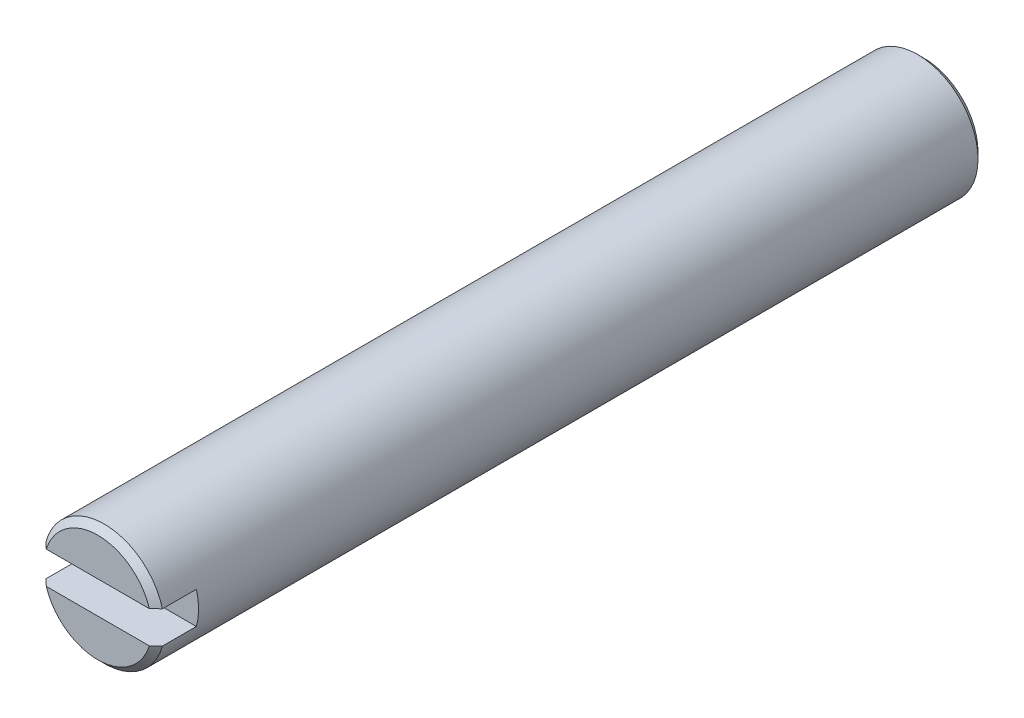
ISO-10303-21;
HEADER;
FILE_DESCRIPTION(('STEP AP214'),'2;1');
FILE_NAME('part.step','',(''),(''),'','','');
FILE_SCHEMA(('AUTOMOTIVE_DESIGN { 1 0 10303 214 1 1 1 1 }'));
ENDSEC;
DATA;
#1=APPLICATION_CONTEXT('core data for automotive mechanical design processes');
#2=APPLICATION_PROTOCOL_DEFINITION('international standard','automotive_design',2000,#1);
#3=PRODUCT_CONTEXT('',#1,'mechanical');
#4=PRODUCT('Part','Part','',(#3));
#5=PRODUCT_RELATED_PRODUCT_CATEGORY('part','',(#4));
#6=PRODUCT_DEFINITION_FORMATION('','',#4);
#7=PRODUCT_DEFINITION_CONTEXT('part definition',#1,'design');
#8=PRODUCT_DEFINITION('design','',#6,#7);
#9=PRODUCT_DEFINITION_SHAPE('','',#8);
#10=(LENGTH_UNIT() NAMED_UNIT(*) SI_UNIT(.MILLI.,.METRE.));
#11=(NAMED_UNIT(*) PLANE_ANGLE_UNIT() SI_UNIT($,.RADIAN.));
#12=(NAMED_UNIT(*) SI_UNIT($,.STERADIAN.) SOLID_ANGLE_UNIT());
#13=UNCERTAINTY_MEASURE_WITH_UNIT(LENGTH_MEASURE(1.E-05),#10,'distance_accuracy_value','');
#14=(GEOMETRIC_REPRESENTATION_CONTEXT(3) GLOBAL_UNCERTAINTY_ASSIGNED_CONTEXT((#13)) GLOBAL_UNIT_ASSIGNED_CONTEXT((#10,
#11,#12)) REPRESENTATION_CONTEXT('',''));
#15=CARTESIAN_POINT('',(0.,0.,0.));
#16=DIRECTION('',(0.,0.,1.));
#17=DIRECTION('',(1.,0.,0.));
#18=AXIS2_PLACEMENT_3D('',#15,#16,#17);
#19=CARTESIAN_POINT('',(0.,0.,25.63));
#20=DIRECTION('',(0.,0.,-1.));
#21=DIRECTION('',(-1.,0.,0.));
#22=AXIS2_PLACEMENT_3D('',#19,#20,#21);
#23=CYLINDRICAL_SURFACE('',#22,1.875);
#24=CARTESIAN_POINT('',(0.,0.,0.199999999999999));
#25=DIRECTION('',(0.,0.,1.));
#26=DIRECTION('',(1.,0.,0.));
#27=AXIS2_PLACEMENT_3D('',#24,#25,#26);
#28=CIRCLE('',#27,1.875);
#29=CARTESIAN_POINT('',(1.875,0.,0.199999999999999));
#30=VERTEX_POINT('',#29);
#31=EDGE_CURVE('E53',#30,#30,#28,.T.);
#32=ORIENTED_EDGE('',*,*,#31,.T.);
#33=EDGE_LOOP('',(#32));
#34=FACE_BOUND('',#33,.T.);
#35=DIRECTION('',(0.,0.,1.));
#36=VECTOR('',#35,1.);
#37=CARTESIAN_POINT('',(1.80710403685012,-0.5,24.38));
#38=LINE('',#37,#36);
#39=CARTESIAN_POINT('',(1.80710403685012,-0.5,24.38));
#40=VERTEX_POINT('',#39);
#41=CARTESIAN_POINT('',(1.80710403685012,-0.5,25.43));
#42=VERTEX_POINT('',#41);
#43=EDGE_CURVE('E109',#40,#42,#38,.T.);
#44=ORIENTED_EDGE('',*,*,#43,.T.);
#45=CARTESIAN_POINT('',(0.,0.,25.43));
#46=DIRECTION('',(0.,0.,1.));
#47=DIRECTION('',(1.,0.,0.));
#48=AXIS2_PLACEMENT_3D('',#45,#46,#47);
#49=CIRCLE('',#48,1.875);
#50=CARTESIAN_POINT('',(-1.80710403685012,-0.5,25.43));
#51=VERTEX_POINT('',#50);
#52=EDGE_CURVE('E127',#42,#51,#49,.F.);
#53=ORIENTED_EDGE('',*,*,#52,.T.);
#54=DIRECTION('',(0.,0.,1.));
#55=VECTOR('',#54,1.);
#56=CARTESIAN_POINT('',(-1.80710403685012,-0.5,24.38));
#57=LINE('',#56,#55);
#58=CARTESIAN_POINT('',(-1.80710403685012,-0.5,24.38));
#59=VERTEX_POINT('',#58);
#60=EDGE_CURVE('E106',#59,#51,#57,.T.);
#61=ORIENTED_EDGE('',*,*,#60,.F.);
#62=CARTESIAN_POINT('',(0.,0.,24.38));
#63=DIRECTION('',(0.,0.,1.));
#64=DIRECTION('',(1.,0.,0.));
#65=AXIS2_PLACEMENT_3D('',#62,#63,#64);
#66=CIRCLE('',#65,1.875);
#67=CARTESIAN_POINT('',(-1.80710403685012,0.5,24.38));
#68=VERTEX_POINT('',#67);
#69=EDGE_CURVE('E115',#68,#59,#66,.T.);
#70=ORIENTED_EDGE('',*,*,#69,.F.);
#71=DIRECTION('',(0.,0.,1.));
#72=VECTOR('',#71,1.);
#73=CARTESIAN_POINT('',(-1.80710403685012,0.5,24.38));
#74=LINE('',#73,#72);
#75=CARTESIAN_POINT('',(-1.80710403685012,0.5,25.43));
#76=VERTEX_POINT('',#75);
#77=EDGE_CURVE('E142',#68,#76,#74,.T.);
#78=ORIENTED_EDGE('',*,*,#77,.T.);
#79=CARTESIAN_POINT('',(0.,0.,25.43));
#80=DIRECTION('',(0.,0.,1.));
#81=DIRECTION('',(1.,0.,0.));
#82=AXIS2_PLACEMENT_3D('',#79,#80,#81);
#83=CIRCLE('',#82,1.875);
#84=CARTESIAN_POINT('',(1.80710403685012,0.5,25.43));
#85=VERTEX_POINT('',#84);
#86=EDGE_CURVE('E212',#76,#85,#83,.F.);
#87=ORIENTED_EDGE('',*,*,#86,.T.);
#88=DIRECTION('',(0.,0.,1.));
#89=VECTOR('',#88,1.);
#90=CARTESIAN_POINT('',(1.80710403685012,0.5,24.38));
#91=LINE('',#90,#89);
#92=CARTESIAN_POINT('',(1.80710403685012,0.5,24.38));
#93=VERTEX_POINT('',#92);
#94=EDGE_CURVE('E132',#93,#85,#91,.T.);
#95=ORIENTED_EDGE('',*,*,#94,.F.);
#96=CARTESIAN_POINT('',(0.,0.,24.38));
#97=DIRECTION('',(0.,0.,1.));
#98=DIRECTION('',(1.,0.,0.));
#99=AXIS2_PLACEMENT_3D('',#96,#97,#98);
#100=CIRCLE('',#99,1.875);
#101=EDGE_CURVE('E114',#40,#93,#100,.T.);
#102=ORIENTED_EDGE('',*,*,#101,.F.);
#103=EDGE_LOOP('',(#44,#53,#61,#70,#78,#87,#95,#102));
#104=FACE_BOUND('',#103,.T.);
#105=ADVANCED_FACE('F43',(#34,#104),#23,.T.);
#106=CARTESIAN_POINT('',(0.,0.,25.63));
#107=DIRECTION('',(0.,0.,1.));
#108=DIRECTION('',(1.,0.,0.));
#109=AXIS2_PLACEMENT_3D('',#106,#107,#108);
#110=PLANE('',#109);
#111=DIRECTION('',(1.,0.,0.));
#112=VECTOR('',#111,1.);
#113=CARTESIAN_POINT('',(-1.80710403685012,0.5,25.63));
#114=LINE('',#113,#112);
#115=CARTESIAN_POINT('',(-1.59863222787482,0.5,25.63));
#116=VERTEX_POINT('',#115);
#117=CARTESIAN_POINT('',(1.59863222787482,0.5,25.63));
#118=VERTEX_POINT('',#117);
#119=EDGE_CURVE('E124',#116,#118,#114,.T.);
#120=ORIENTED_EDGE('',*,*,#119,.T.);
#121=CARTESIAN_POINT('',(0.,0.,25.63));
#122=DIRECTION('',(0.,0.,1.));
#123=DIRECTION('',(1.,0.,0.));
#124=AXIS2_PLACEMENT_3D('',#121,#122,#123);
#125=CIRCLE('',#124,1.675);
#126=EDGE_CURVE('E213',#118,#116,#125,.T.);
#127=ORIENTED_EDGE('',*,*,#126,.T.);
#128=EDGE_LOOP('',(#120,#127));
#129=FACE_BOUND('',#128,.T.);
#130=ADVANCED_FACE('F173',(#129),#110,.T.);
#131=DIRECTION('',(1.,0.,0.));
#132=VECTOR('',#131,1.);
#133=CARTESIAN_POINT('',(-1.80710403685012,-0.5,25.63));
#134=LINE('',#133,#132);
#135=CARTESIAN_POINT('',(-1.59863222787482,-0.5,25.63));
#136=VERTEX_POINT('',#135);
#137=CARTESIAN_POINT('',(1.59863222787481,-0.5,25.63));
#138=VERTEX_POINT('',#137);
#139=EDGE_CURVE('E222',#136,#138,#134,.T.);
#140=ORIENTED_EDGE('',*,*,#139,.F.);
#141=CARTESIAN_POINT('',(0.,0.,25.63));
#142=DIRECTION('',(0.,0.,1.));
#143=DIRECTION('',(1.,0.,0.));
#144=AXIS2_PLACEMENT_3D('',#141,#142,#143);
#145=CIRCLE('',#144,1.675);
#146=EDGE_CURVE('E137',#136,#138,#145,.T.);
#147=ORIENTED_EDGE('',*,*,#146,.T.);
#148=EDGE_LOOP('',(#140,#147));
#149=FACE_BOUND('',#148,.T.);
#150=ADVANCED_FACE('F168',(#149),#110,.T.);
#151=CARTESIAN_POINT('',(0.,0.,0.));
#152=DIRECTION('',(0.,0.,1.));
#153=DIRECTION('',(1.,0.,0.));
#154=AXIS2_PLACEMENT_3D('',#151,#152,#153);
#155=PLANE('',#154);
#156=CARTESIAN_POINT('',(0.,0.,0.));
#157=DIRECTION('',(0.,0.,1.));
#158=DIRECTION('',(1.,0.,0.));
#159=AXIS2_PLACEMENT_3D('',#156,#157,#158);
#160=CIRCLE('',#159,1.675);
#161=CARTESIAN_POINT('',(1.675,0.,0.));
#162=VERTEX_POINT('',#161);
#163=EDGE_CURVE('E11',#162,#162,#160,.F.);
#164=ORIENTED_EDGE('',*,*,#163,.T.);
#165=EDGE_LOOP('',(#164));
#166=FACE_BOUND('',#165,.T.);
#167=ADVANCED_FACE('F172',(#166),#155,.F.);
#168=CARTESIAN_POINT('',(-1.80710403685012,0.5,24.38));
#169=DIRECTION('',(0.,-1.,0.));
#170=DIRECTION('',(0.,0.,-1.));
#171=AXIS2_PLACEMENT_3D('',#168,#169,#170);
#172=PLANE('',#171);
#173=ORIENTED_EDGE('',*,*,#119,.F.);
#174=CARTESIAN_POINT('',(-1.59863222787482,0.5,25.63));
#175=CARTESIAN_POINT('',(-1.63345869493428,0.5,25.5967512645176));
#176=CARTESIAN_POINT('',(-1.66824458065941,0.5,25.5634602287143));
#177=CARTESIAN_POINT('',(-1.73773518363762,0.5,25.4967935620335));
#178=CARTESIAN_POINT('',(-1.77243990090426,0.5,25.4634179311701));
#179=CARTESIAN_POINT('',(-1.80710403685012,0.5,25.43));
#180=B_SPLINE_CURVE_WITH_KNOTS('',3,(#174,#175,#176,#177,#178,#179),.UNSPECIFIED.,.F.,.F.,(4,2,
4),(0.,0.144447769781472,0.288895515436325),.UNSPECIFIED.);
#181=EDGE_CURVE('E68',#116,#76,#180,.T.);
#182=ORIENTED_EDGE('',*,*,#181,.T.);
#183=ORIENTED_EDGE('',*,*,#77,.F.);
#184=DIRECTION('',(1.,0.,0.));
#185=VECTOR('',#184,1.);
#186=CARTESIAN_POINT('',(-1.80710403685012,0.5,24.38));
#187=LINE('',#186,#185);
#188=EDGE_CURVE('E120',#68,#93,#187,.T.);
#189=ORIENTED_EDGE('',*,*,#188,.T.);
#190=ORIENTED_EDGE('',*,*,#94,.T.);
#191=CARTESIAN_POINT('',(1.80710403685012,0.5,25.43));
#192=CARTESIAN_POINT('',(1.77243990090426,0.5,25.4634179311701));
#193=CARTESIAN_POINT('',(1.73773518363762,0.5,25.4967935620335));
#194=CARTESIAN_POINT('',(1.66824458065941,0.5,25.5634602287143));
#195=CARTESIAN_POINT('',(1.63345869493428,0.5,25.5967512645176));
#196=CARTESIAN_POINT('',(1.59863222787482,0.5,25.63));
#197=B_SPLINE_CURVE_WITH_KNOTS('',3,(#191,#192,#193,#194,#195,#196),.UNSPECIFIED.,.F.,.F.,(4,2,
4),(0.,0.144447745654853,0.288895515436325),.UNSPECIFIED.);
#198=EDGE_CURVE('E60',#85,#118,#197,.T.);
#199=ORIENTED_EDGE('',*,*,#198,.T.);
#200=EDGE_LOOP('',(#173,#182,#183,#189,#190,#199));
#201=FACE_BOUND('',#200,.T.);
#202=ADVANCED_FACE('F165',(#201),#172,.T.);
#203=CARTESIAN_POINT('',(-1.80710403685012,-0.5,24.38));
#204=DIRECTION('',(0.,-1.,0.));
#205=DIRECTION('',(0.,0.,-1.));
#206=AXIS2_PLACEMENT_3D('',#203,#204,#205);
#207=PLANE('',#206);
#208=ORIENTED_EDGE('',*,*,#139,.T.);
#209=CARTESIAN_POINT('',(1.59863222787482,-0.5,25.63));
#210=CARTESIAN_POINT('',(1.63345869493428,-0.5,25.5967512645176));
#211=CARTESIAN_POINT('',(1.66824458065941,-0.5,25.5634602287143));
#212=CARTESIAN_POINT('',(1.73773518363762,-0.5,25.4967935620335));
#213=CARTESIAN_POINT('',(1.77243990090426,-0.5,25.4634179311701));
#214=CARTESIAN_POINT('',(1.80710403685012,-0.5,25.43));
#215=B_SPLINE_CURVE_WITH_KNOTS('',3,(#209,#210,#211,#212,#213,#214),.UNSPECIFIED.,.F.,.F.,(4,2,
4),(0.,0.144447769781472,0.288895515436325),.UNSPECIFIED.);
#216=EDGE_CURVE('E151',#138,#42,#215,.T.);
#217=ORIENTED_EDGE('',*,*,#216,.T.);
#218=ORIENTED_EDGE('',*,*,#43,.F.);
#219=DIRECTION('',(1.,0.,0.));
#220=VECTOR('',#219,1.);
#221=CARTESIAN_POINT('',(-1.80710403685012,-0.5,24.38));
#222=LINE('',#221,#220);
#223=EDGE_CURVE('E101',#59,#40,#222,.T.);
#224=ORIENTED_EDGE('',*,*,#223,.F.);
#225=ORIENTED_EDGE('',*,*,#60,.T.);
#226=CARTESIAN_POINT('',(-1.80710403685012,-0.5,25.43));
#227=CARTESIAN_POINT('',(-1.77243990090426,-0.5,25.4634179311701));
#228=CARTESIAN_POINT('',(-1.73773518363762,-0.5,25.4967935620335));
#229=CARTESIAN_POINT('',(-1.66824458065941,-0.5,25.5634602287143));
#230=CARTESIAN_POINT('',(-1.63345869493428,-0.5,25.5967512645176));
#231=CARTESIAN_POINT('',(-1.59863222787482,-0.5,25.63));
#232=B_SPLINE_CURVE_WITH_KNOTS('',3,(#226,#227,#228,#229,#230,#231),.UNSPECIFIED.,.F.,.F.,(4,2,
4),(0.,0.144447745654853,0.288895515436325),.UNSPECIFIED.);
#233=EDGE_CURVE('E141',#51,#136,#232,.T.);
#234=ORIENTED_EDGE('',*,*,#233,.T.);
#235=EDGE_LOOP('',(#208,#217,#218,#224,#225,#234));
#236=FACE_BOUND('',#235,.T.);
#237=ADVANCED_FACE('F104',(#236),#207,.F.);
#238=CARTESIAN_POINT('',(0.,0.,24.38));
#239=DIRECTION('',(0.,0.,1.));
#240=DIRECTION('',(1.,0.,0.));
#241=AXIS2_PLACEMENT_3D('',#238,#239,#240);
#242=PLANE('',#241);
#243=ORIENTED_EDGE('',*,*,#69,.T.);
#244=ORIENTED_EDGE('',*,*,#223,.T.);
#245=ORIENTED_EDGE('',*,*,#101,.T.);
#246=ORIENTED_EDGE('',*,*,#188,.F.);
#247=EDGE_LOOP('',(#243,#244,#245,#246));
#248=FACE_BOUND('',#247,.T.);
#249=ADVANCED_FACE('F119',(#248),#242,.T.);
#250=CARTESIAN_POINT('',(0.,0.,25.63));
#251=DIRECTION('',(0.,0.,-1.));
#252=DIRECTION('',(-1.,0.,0.));
#253=AXIS2_PLACEMENT_3D('',#250,#251,#252);
#254=CONICAL_SURFACE('',#253,1.675,0.785398163397453);
#255=ORIENTED_EDGE('',*,*,#233,.F.);
#256=ORIENTED_EDGE('',*,*,#52,.F.);
#257=ORIENTED_EDGE('',*,*,#216,.F.);
#258=ORIENTED_EDGE('',*,*,#146,.F.);
#259=EDGE_LOOP('',(#255,#256,#257,#258));
#260=FACE_BOUND('',#259,.T.);
#261=ADVANCED_FACE('F158',(#260),#254,.T.);
#262=CARTESIAN_POINT('',(0.,0.,25.63));
#263=DIRECTION('',(0.,0.,-1.));
#264=DIRECTION('',(-1.,0.,0.));
#265=AXIS2_PLACEMENT_3D('',#262,#263,#264);
#266=CONICAL_SURFACE('',#265,1.675,0.785398163397453);
#267=ORIENTED_EDGE('',*,*,#198,.F.);
#268=ORIENTED_EDGE('',*,*,#86,.F.);
#269=ORIENTED_EDGE('',*,*,#181,.F.);
#270=ORIENTED_EDGE('',*,*,#126,.F.);
#271=EDGE_LOOP('',(#267,#268,#269,#270));
#272=FACE_BOUND('',#271,.T.);
#273=ADVANCED_FACE('F200',(#272),#266,.T.);
#274=CARTESIAN_POINT('',(0.,0.,0.199999999999999));
#275=DIRECTION('',(0.,0.,1.));
#276=DIRECTION('',(1.,0.,0.));
#277=AXIS2_PLACEMENT_3D('',#274,#275,#276);
#278=CONICAL_SURFACE('',#277,1.875,0.785398163397452);
#279=ORIENTED_EDGE('',*,*,#163,.F.);
#280=EDGE_LOOP('',(#279));
#281=FACE_BOUND('',#280,.T.);
#282=ORIENTED_EDGE('',*,*,#31,.F.);
#283=EDGE_LOOP('',(#282));
#284=FACE_BOUND('',#283,.T.);
#285=ADVANCED_FACE('F46',(#281,#284),#278,.T.);
#286=CLOSED_SHELL('',(#105,#130,#150,#167,#202,#237,#249,#261,#273,#285));
#287=MANIFOLD_SOLID_BREP('B2',#286);
#288=ADVANCED_BREP_SHAPE_REPRESENTATION('',(#18,#287),#14);
#289=SHAPE_DEFINITION_REPRESENTATION(#9,#288);
ENDSEC;
END-ISO-10303-21;
